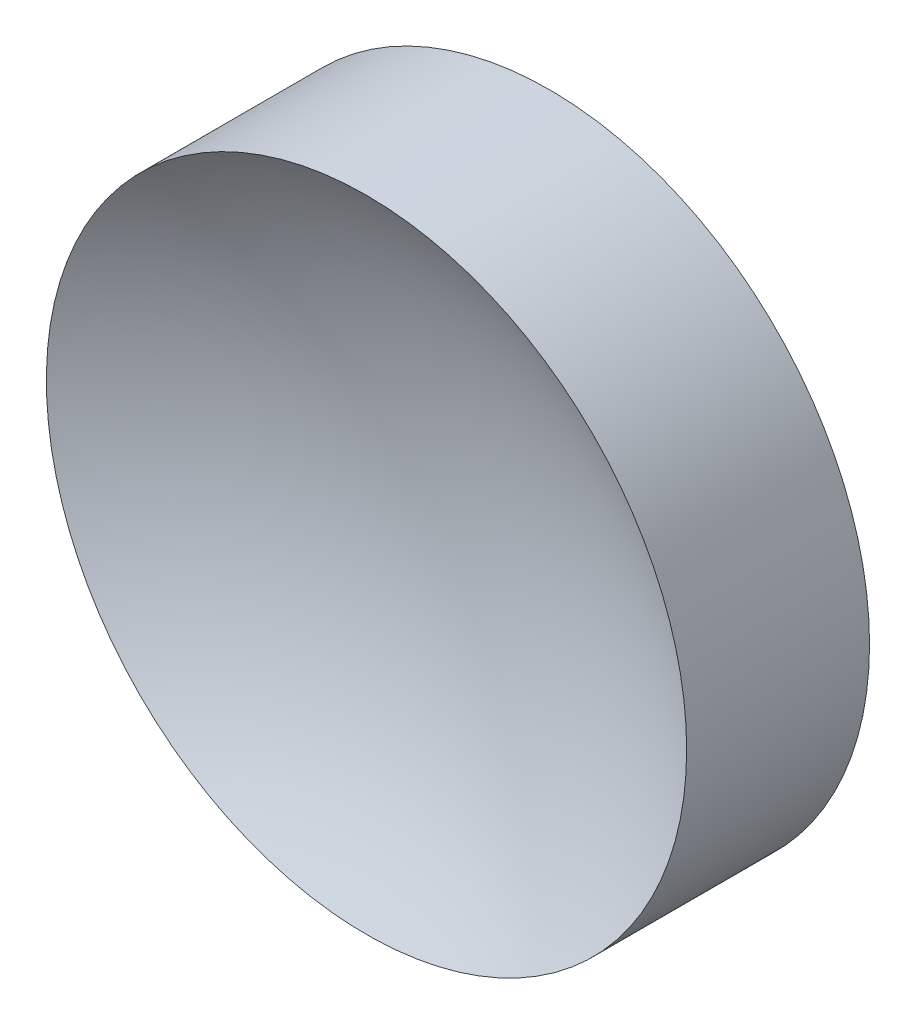
ISO-10303-21;
HEADER;
FILE_DESCRIPTION(('STEP AP214'),'2;1');
FILE_NAME('part.step','',(''),(''),'','','');
FILE_SCHEMA(('AUTOMOTIVE_DESIGN { 1 0 10303 214 1 1 1 1 }'));
ENDSEC;
DATA;
#1=APPLICATION_CONTEXT('core data for automotive mechanical design processes');
#2=APPLICATION_PROTOCOL_DEFINITION('international standard','automotive_design',2000,#1);
#3=PRODUCT_CONTEXT('',#1,'mechanical');
#4=PRODUCT('Part','Part','',(#3));
#5=PRODUCT_RELATED_PRODUCT_CATEGORY('part','',(#4));
#6=PRODUCT_DEFINITION_FORMATION('','',#4);
#7=PRODUCT_DEFINITION_CONTEXT('part definition',#1,'design');
#8=PRODUCT_DEFINITION('design','',#6,#7);
#9=PRODUCT_DEFINITION_SHAPE('','',#8);
#10=(LENGTH_UNIT() NAMED_UNIT(*) SI_UNIT(.MILLI.,.METRE.));
#11=(NAMED_UNIT(*) PLANE_ANGLE_UNIT() SI_UNIT($,.RADIAN.));
#12=(NAMED_UNIT(*) SI_UNIT($,.STERADIAN.) SOLID_ANGLE_UNIT());
#13=UNCERTAINTY_MEASURE_WITH_UNIT(LENGTH_MEASURE(1.E-05),#10,'distance_accuracy_value','');
#14=(GEOMETRIC_REPRESENTATION_CONTEXT(3) GLOBAL_UNCERTAINTY_ASSIGNED_CONTEXT((#13)) GLOBAL_UNIT_ASSIGNED_CONTEXT((#10,
#11,#12)) REPRESENTATION_CONTEXT('',''));
#15=CARTESIAN_POINT('',(0.,0.,0.));
#16=DIRECTION('',(0.,0.,1.));
#17=DIRECTION('',(1.,0.,0.));
#18=AXIS2_PLACEMENT_3D('',#15,#16,#17);
#19=CARTESIAN_POINT('',(0.,0.,25.1));
#20=DIRECTION('',(0.,0.,1.));
#21=DIRECTION('',(0.,1.,0.));
#22=AXIS2_PLACEMENT_3D('',#19,#20,#21);
#23=SPHERICAL_SURFACE('',#22,23.35);
#24=CARTESIAN_POINT('',(0.,0.,5.50580443090352));
#25=DIRECTION('',(0.,0.,1.));
#26=DIRECTION('',(1.,0.,0.));
#27=AXIS2_PLACEMENT_3D('',#24,#25,#26);
#28=CIRCLE('',#27,12.7);
#29=CARTESIAN_POINT('',(12.7,0.,5.50580443090352));
#30=VERTEX_POINT('',#29);
#31=EDGE_CURVE('E21',#30,#30,#28,.T.);
#32=ORIENTED_EDGE('',*,*,#31,.T.);
#33=EDGE_LOOP('',(#32));
#34=FACE_BOUND('',#33,.T.);
#35=ADVANCED_FACE('F15',(#34),#23,.F.);
#36=CARTESIAN_POINT('',(0.,0.,-1.75));
#37=DIRECTION('',(0.,0.,1.));
#38=DIRECTION('',(1.,0.,0.));
#39=AXIS2_PLACEMENT_3D('',#36,#37,#38);
#40=PLANE('',#39);
#41=CARTESIAN_POINT('',(0.,0.,-1.75));
#42=DIRECTION('',(0.,0.,1.));
#43=DIRECTION('',(1.,0.,0.));
#44=AXIS2_PLACEMENT_3D('',#41,#42,#43);
#45=CIRCLE('',#44,12.7);
#46=CARTESIAN_POINT('',(12.7,0.,-1.75));
#47=VERTEX_POINT('',#46);
#48=EDGE_CURVE('E10',#47,#47,#45,.T.);
#49=ORIENTED_EDGE('',*,*,#48,.F.);
#50=EDGE_LOOP('',(#49));
#51=FACE_BOUND('',#50,.T.);
#52=ADVANCED_FACE('F30',(#51),#40,.F.);
#53=CARTESIAN_POINT('',(0.,0.,9.01715327042933));
#54=DIRECTION('',(0.,0.,1.));
#55=DIRECTION('',(1.,0.,0.));
#56=AXIS2_PLACEMENT_3D('',#53,#54,#55);
#57=CYLINDRICAL_SURFACE('',#56,12.7);
#58=ORIENTED_EDGE('',*,*,#31,.F.);
#59=EDGE_LOOP('',(#58));
#60=FACE_BOUND('',#59,.T.);
#61=ORIENTED_EDGE('',*,*,#48,.T.);
#62=EDGE_LOOP('',(#61));
#63=FACE_BOUND('',#62,.T.);
#64=ADVANCED_FACE('F28',(#60,#63),#57,.T.);
#65=CLOSED_SHELL('',(#35,#52,#64));
#66=MANIFOLD_SOLID_BREP('B1',#65);
#67=ADVANCED_BREP_SHAPE_REPRESENTATION('',(#18,#66),#14);
#68=SHAPE_DEFINITION_REPRESENTATION(#9,#67);
ENDSEC;
END-ISO-10303-21;
